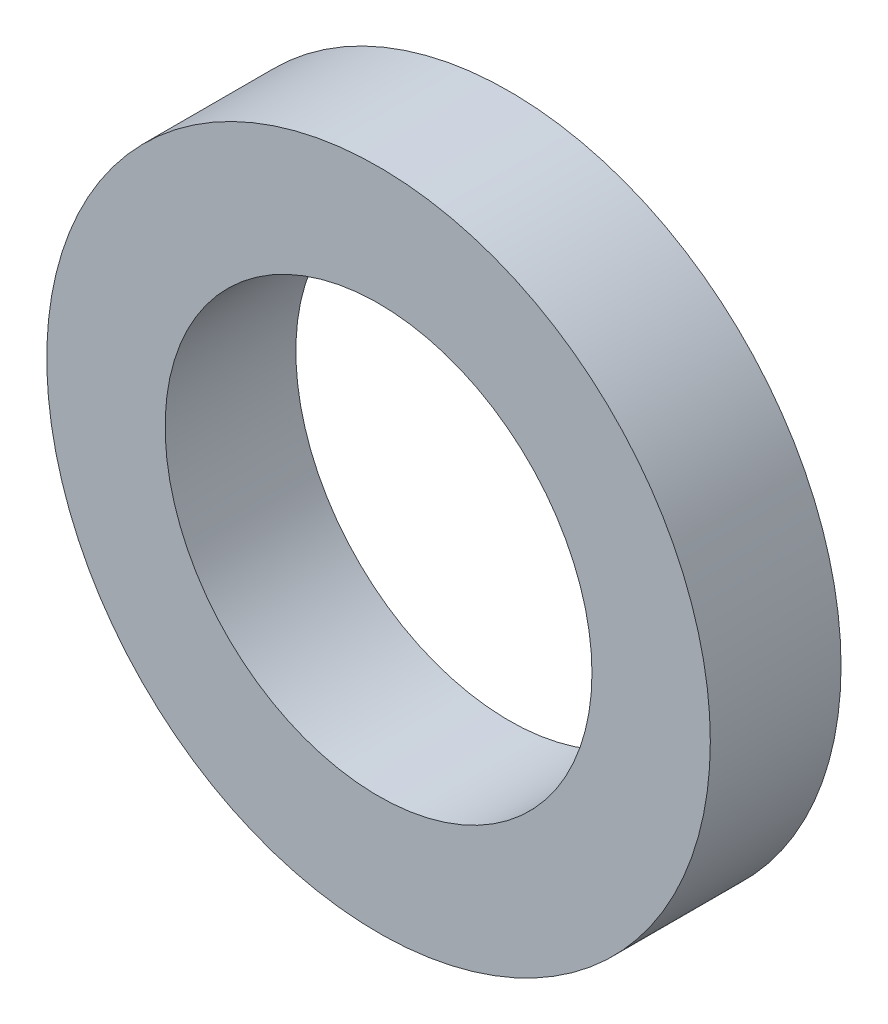
ISO-10303-21;
HEADER;
FILE_DESCRIPTION(('STEP AP214'),'2;1');
FILE_NAME('part.step','',(''),(''),'','','');
FILE_SCHEMA(('AUTOMOTIVE_DESIGN { 1 0 10303 214 1 1 1 1 }'));
ENDSEC;
DATA;
#1=APPLICATION_CONTEXT('core data for automotive mechanical design processes');
#2=APPLICATION_PROTOCOL_DEFINITION('international standard','automotive_design',2000,#1);
#3=PRODUCT_CONTEXT('',#1,'mechanical');
#4=PRODUCT('Part','Part','',(#3));
#5=PRODUCT_RELATED_PRODUCT_CATEGORY('part','',(#4));
#6=PRODUCT_DEFINITION_FORMATION('','',#4);
#7=PRODUCT_DEFINITION_CONTEXT('part definition',#1,'design');
#8=PRODUCT_DEFINITION('design','',#6,#7);
#9=PRODUCT_DEFINITION_SHAPE('','',#8);
#10=(LENGTH_UNIT() NAMED_UNIT(*) SI_UNIT(.MILLI.,.METRE.));
#11=(NAMED_UNIT(*) PLANE_ANGLE_UNIT() SI_UNIT($,.RADIAN.));
#12=(NAMED_UNIT(*) SI_UNIT($,.STERADIAN.) SOLID_ANGLE_UNIT());
#13=UNCERTAINTY_MEASURE_WITH_UNIT(LENGTH_MEASURE(1.E-05),#10,'distance_accuracy_value','');
#14=(GEOMETRIC_REPRESENTATION_CONTEXT(3) GLOBAL_UNCERTAINTY_ASSIGNED_CONTEXT((#13)) GLOBAL_UNIT_ASSIGNED_CONTEXT((#10,
#11,#12)) REPRESENTATION_CONTEXT('',''));
#15=CARTESIAN_POINT('',(0.,0.,0.));
#16=DIRECTION('',(0.,0.,1.));
#17=DIRECTION('',(1.,0.,0.));
#18=AXIS2_PLACEMENT_3D('',#15,#16,#17);
#19=CARTESIAN_POINT('',(164.79980395356,1350.51395299235,13.97));
#20=DIRECTION('',(0.,0.,1.));
#21=DIRECTION('',(1.,0.,0.));
#22=AXIS2_PLACEMENT_3D('',#19,#20,#21);
#23=PLANE('',#22);
#24=CARTESIAN_POINT('',(164.79980395356,1350.51395299235,13.97));
#25=DIRECTION('',(0.,0.,1.));
#26=DIRECTION('',(1.,0.,0.));
#27=AXIS2_PLACEMENT_3D('',#24,#25,#26);
#28=CIRCLE('',#27,35.4584000000001);
#29=CARTESIAN_POINT('',(200.25820395356,1350.51395299235,13.97));
#30=VERTEX_POINT('',#29);
#31=EDGE_CURVE('E10',#30,#30,#28,.T.);
#32=ORIENTED_EDGE('',*,*,#31,.T.);
#33=EDGE_LOOP('',(#32));
#34=FACE_BOUND('',#33,.T.);
#35=CARTESIAN_POINT('',(164.79980395356,1350.51395299235,13.97));
#36=DIRECTION('',(0.,0.,1.));
#37=DIRECTION('',(1.,0.,0.));
#38=AXIS2_PLACEMENT_3D('',#35,#36,#37);
#39=CIRCLE('',#38,22.8092000000001);
#40=CARTESIAN_POINT('',(187.60900395356,1350.51395299235,13.97));
#41=VERTEX_POINT('',#40);
#42=EDGE_CURVE('E43',#41,#41,#39,.T.);
#43=ORIENTED_EDGE('',*,*,#42,.F.);
#44=EDGE_LOOP('',(#43));
#45=FACE_BOUND('',#44,.T.);
#46=ADVANCED_FACE('F32',(#34,#45),#23,.T.);
#47=CARTESIAN_POINT('',(164.79980395356,1350.51395299235,0.));
#48=DIRECTION('',(0.,0.,1.));
#49=DIRECTION('',(1.,0.,0.));
#50=AXIS2_PLACEMENT_3D('',#47,#48,#49);
#51=PLANE('',#50);
#52=CARTESIAN_POINT('',(164.79980395356,1350.51395299235,0.));
#53=DIRECTION('',(0.,0.,1.));
#54=DIRECTION('',(1.,0.,0.));
#55=AXIS2_PLACEMENT_3D('',#52,#53,#54);
#56=CIRCLE('',#55,35.4584000000001);
#57=CARTESIAN_POINT('',(200.25820395356,1350.51395299235,0.));
#58=VERTEX_POINT('',#57);
#59=EDGE_CURVE('E36',#58,#58,#56,.T.);
#60=ORIENTED_EDGE('',*,*,#59,.F.);
#61=EDGE_LOOP('',(#60));
#62=FACE_BOUND('',#61,.T.);
#63=CARTESIAN_POINT('',(164.79980395356,1350.51395299235,0.));
#64=DIRECTION('',(0.,0.,1.));
#65=DIRECTION('',(1.,0.,0.));
#66=AXIS2_PLACEMENT_3D('',#63,#64,#65);
#67=CIRCLE('',#66,22.8092000000001);
#68=CARTESIAN_POINT('',(187.60900395356,1350.51395299235,0.));
#69=VERTEX_POINT('',#68);
#70=EDGE_CURVE('E45',#69,#69,#67,.T.);
#71=ORIENTED_EDGE('',*,*,#70,.T.);
#72=EDGE_LOOP('',(#71));
#73=FACE_BOUND('',#72,.T.);
#74=ADVANCED_FACE('F55',(#62,#73),#51,.F.);
#75=CARTESIAN_POINT('',(164.79980395356,1350.51395299235,13.97));
#76=DIRECTION('',(0.,0.,-1.));
#77=DIRECTION('',(-1.,0.,0.));
#78=AXIS2_PLACEMENT_3D('',#75,#76,#77);
#79=CYLINDRICAL_SURFACE('',#78,35.4584000000001);
#80=ORIENTED_EDGE('',*,*,#31,.F.);
#81=EDGE_LOOP('',(#80));
#82=FACE_BOUND('',#81,.T.);
#83=ORIENTED_EDGE('',*,*,#59,.T.);
#84=EDGE_LOOP('',(#83));
#85=FACE_BOUND('',#84,.T.);
#86=ADVANCED_FACE('F34',(#82,#85),#79,.T.);
#87=CARTESIAN_POINT('',(164.79980395356,1350.51395299235,13.97));
#88=DIRECTION('',(0.,0.,-1.));
#89=DIRECTION('',(-1.,0.,0.));
#90=AXIS2_PLACEMENT_3D('',#87,#88,#89);
#91=CYLINDRICAL_SURFACE('',#90,22.8092000000001);
#92=ORIENTED_EDGE('',*,*,#42,.T.);
#93=EDGE_LOOP('',(#92));
#94=FACE_BOUND('',#93,.T.);
#95=ORIENTED_EDGE('',*,*,#70,.F.);
#96=EDGE_LOOP('',(#95));
#97=FACE_BOUND('',#96,.T.);
#98=ADVANCED_FACE('F51',(#94,#97),#91,.F.);
#99=CLOSED_SHELL('',(#46,#74,#86,#98));
#100=MANIFOLD_SOLID_BREP('B2',#99);
#101=ADVANCED_BREP_SHAPE_REPRESENTATION('',(#18,#100),#14);
#102=SHAPE_DEFINITION_REPRESENTATION(#9,#101);
ENDSEC;
END-ISO-10303-21;
